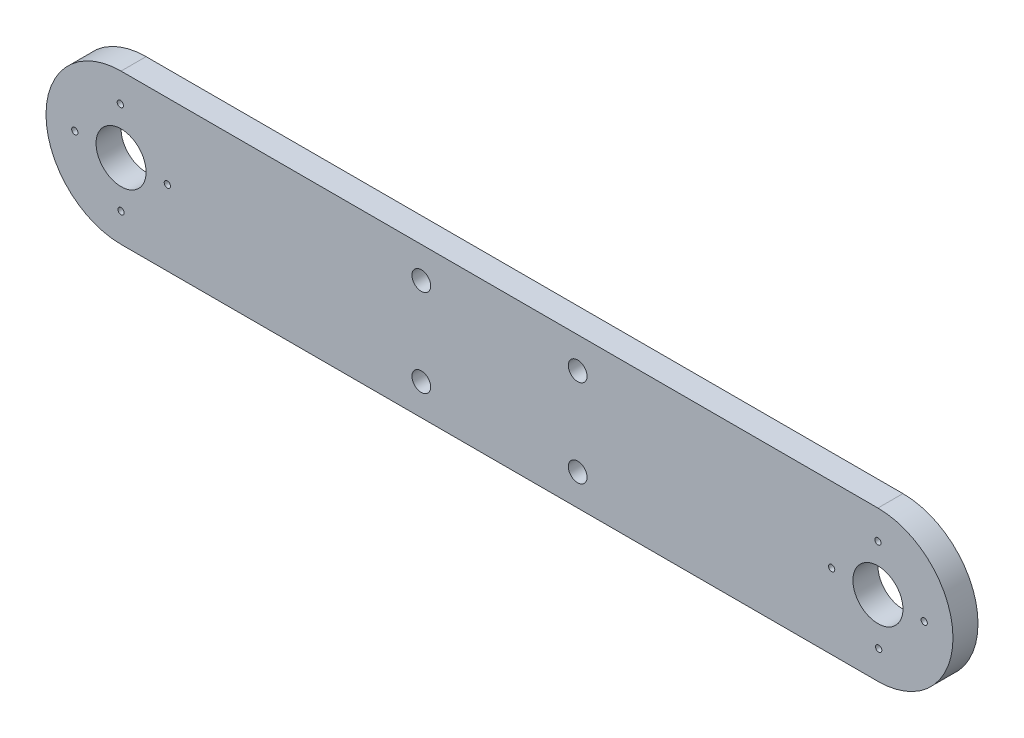
ISO-10303-21;
HEADER;
FILE_DESCRIPTION(('STEP AP214'),'2;1');
FILE_NAME('part.step','',(''),(''),'','','');
FILE_SCHEMA(('AUTOMOTIVE_DESIGN { 1 0 10303 214 1 1 1 1 }'));
ENDSEC;
DATA;
#1=APPLICATION_CONTEXT('core data for automotive mechanical design processes');
#2=APPLICATION_PROTOCOL_DEFINITION('international standard','automotive_design',2000,#1);
#3=PRODUCT_CONTEXT('',#1,'mechanical');
#4=PRODUCT('Part','Part','',(#3));
#5=PRODUCT_RELATED_PRODUCT_CATEGORY('part','',(#4));
#6=PRODUCT_DEFINITION_FORMATION('','',#4);
#7=PRODUCT_DEFINITION_CONTEXT('part definition',#1,'design');
#8=PRODUCT_DEFINITION('design','',#6,#7);
#9=PRODUCT_DEFINITION_SHAPE('','',#8);
#10=(LENGTH_UNIT() NAMED_UNIT(*) SI_UNIT(.MILLI.,.METRE.));
#11=(NAMED_UNIT(*) PLANE_ANGLE_UNIT() SI_UNIT($,.RADIAN.));
#12=(NAMED_UNIT(*) SI_UNIT($,.STERADIAN.) SOLID_ANGLE_UNIT());
#13=UNCERTAINTY_MEASURE_WITH_UNIT(LENGTH_MEASURE(1.E-05),#10,'distance_accuracy_value','');
#14=(GEOMETRIC_REPRESENTATION_CONTEXT(3) GLOBAL_UNCERTAINTY_ASSIGNED_CONTEXT((#13)) GLOBAL_UNIT_ASSIGNED_CONTEXT((#10,
#11,#12)) REPRESENTATION_CONTEXT('',''));
#15=CARTESIAN_POINT('',(0.,0.,0.));
#16=DIRECTION('',(0.,0.,1.));
#17=DIRECTION('',(1.,0.,0.));
#18=AXIS2_PLACEMENT_3D('',#15,#16,#17);
#19=CARTESIAN_POINT('',(12.,12.,4.));
#20=DIRECTION('',(0.,0.,1.));
#21=DIRECTION('',(1.,0.,0.));
#22=AXIS2_PLACEMENT_3D('',#19,#20,#21);
#23=PLANE('',#22);
#24=CARTESIAN_POINT('',(4.59999999999999,12.,4.));
#25=DIRECTION('',(0.,0.,1.));
#26=DIRECTION('',(1.,0.,0.));
#27=AXIS2_PLACEMENT_3D('',#24,#25,#26);
#28=CIRCLE('',#27,0.5);
#29=CARTESIAN_POINT('',(5.09999999999999,12.,4.));
#30=VERTEX_POINT('',#29);
#31=EDGE_CURVE('E180',#30,#30,#28,.T.);
#32=ORIENTED_EDGE('',*,*,#31,.F.);
#33=EDGE_LOOP('',(#32));
#34=FACE_BOUND('',#33,.T.);
#35=CARTESIAN_POINT('',(12.,4.6,4.));
#36=DIRECTION('',(0.,0.,1.));
#37=DIRECTION('',(1.,0.,0.));
#38=AXIS2_PLACEMENT_3D('',#35,#36,#37);
#39=CIRCLE('',#38,0.5);
#40=CARTESIAN_POINT('',(12.5,4.6,4.));
#41=VERTEX_POINT('',#40);
#42=EDGE_CURVE('E168',#41,#41,#39,.T.);
#43=ORIENTED_EDGE('',*,*,#42,.F.);
#44=EDGE_LOOP('',(#43));
#45=FACE_BOUND('',#44,.T.);
#46=CARTESIAN_POINT('',(85.,19.,4.));
#47=DIRECTION('',(0.,0.,1.));
#48=DIRECTION('',(1.,0.,0.));
#49=AXIS2_PLACEMENT_3D('',#46,#47,#48);
#50=CIRCLE('',#49,1.5);
#51=CARTESIAN_POINT('',(86.5,19.,4.));
#52=VERTEX_POINT('',#51);
#53=EDGE_CURVE('E156',#52,#52,#50,.T.);
#54=ORIENTED_EDGE('',*,*,#53,.F.);
#55=EDGE_LOOP('',(#54));
#56=FACE_BOUND('',#55,.T.);
#57=CARTESIAN_POINT('',(60.,19.,4.));
#58=DIRECTION('',(0.,0.,1.));
#59=DIRECTION('',(1.,0.,0.));
#60=AXIS2_PLACEMENT_3D('',#57,#58,#59);
#61=CIRCLE('',#60,1.5);
#62=CARTESIAN_POINT('',(61.5,19.,4.));
#63=VERTEX_POINT('',#62);
#64=EDGE_CURVE('E144',#63,#63,#61,.T.);
#65=ORIENTED_EDGE('',*,*,#64,.F.);
#66=EDGE_LOOP('',(#65));
#67=FACE_BOUND('',#66,.T.);
#68=CARTESIAN_POINT('',(125.6,12.,4.));
#69=DIRECTION('',(0.,0.,1.));
#70=DIRECTION('',(1.,0.,0.));
#71=AXIS2_PLACEMENT_3D('',#68,#69,#70);
#72=CIRCLE('',#71,0.5);
#73=CARTESIAN_POINT('',(126.1,12.,4.));
#74=VERTEX_POINT('',#73);
#75=EDGE_CURVE('E132',#74,#74,#72,.T.);
#76=ORIENTED_EDGE('',*,*,#75,.F.);
#77=EDGE_LOOP('',(#76));
#78=FACE_BOUND('',#77,.T.);
#79=CARTESIAN_POINT('',(133.121025162147,4.60098973442209,4.));
#80=DIRECTION('',(0.,0.,1.));
#81=DIRECTION('',(1.,0.,0.));
#82=AXIS2_PLACEMENT_3D('',#79,#80,#81);
#83=CIRCLE('',#82,0.5);
#84=CARTESIAN_POINT('',(133.621025162147,4.60098973442209,4.));
#85=VERTEX_POINT('',#84);
#86=EDGE_CURVE('E120',#85,#85,#83,.T.);
#87=ORIENTED_EDGE('',*,*,#86,.F.);
#88=EDGE_LOOP('',(#87));
#89=FACE_BOUND('',#88,.T.);
#90=CARTESIAN_POINT('',(133.,12.,4.));
#91=DIRECTION('',(0.,0.,1.));
#92=DIRECTION('',(1.,0.,0.));
#93=AXIS2_PLACEMENT_3D('',#90,#91,#92);
#94=CIRCLE('',#93,4.);
#95=CARTESIAN_POINT('',(137.,12.,4.));
#96=VERTEX_POINT('',#95);
#97=EDGE_CURVE('E99',#96,#96,#94,.T.);
#98=ORIENTED_EDGE('',*,*,#97,.F.);
#99=EDGE_LOOP('',(#98));
#100=FACE_BOUND('',#99,.T.);
#101=CARTESIAN_POINT('',(12.,12.,4.));
#102=DIRECTION('',(0.,0.,1.));
#103=DIRECTION('',(1.,0.,0.));
#104=AXIS2_PLACEMENT_3D('',#101,#102,#103);
#105=CIRCLE('',#104,12.);
#106=CARTESIAN_POINT('',(12.,24.,4.));
#107=VERTEX_POINT('',#106);
#108=CARTESIAN_POINT('',(12.,0.,4.));
#109=VERTEX_POINT('',#108);
#110=EDGE_CURVE('E84',#107,#109,#105,.T.);
#111=ORIENTED_EDGE('',*,*,#110,.T.);
#112=DIRECTION('',(1.,0.,0.));
#113=VECTOR('',#112,1.);
#114=CARTESIAN_POINT('',(133.,0.,4.));
#115=LINE('',#114,#113);
#116=CARTESIAN_POINT('',(133.,0.,4.));
#117=VERTEX_POINT('',#116);
#118=EDGE_CURVE('E79',#109,#117,#115,.T.);
#119=ORIENTED_EDGE('',*,*,#118,.T.);
#120=CARTESIAN_POINT('',(133.,12.,4.));
#121=DIRECTION('',(0.,0.,1.));
#122=DIRECTION('',(1.,0.,0.));
#123=AXIS2_PLACEMENT_3D('',#120,#121,#122);
#124=CIRCLE('',#123,12.);
#125=CARTESIAN_POINT('',(133.,24.,4.));
#126=VERTEX_POINT('',#125);
#127=EDGE_CURVE('E82',#117,#126,#124,.T.);
#128=ORIENTED_EDGE('',*,*,#127,.T.);
#129=DIRECTION('',(-1.,0.,0.));
#130=VECTOR('',#129,1.);
#131=CARTESIAN_POINT('',(12.,24.,4.));
#132=LINE('',#131,#130);
#133=EDGE_CURVE('E49',#126,#107,#132,.T.);
#134=ORIENTED_EDGE('',*,*,#133,.T.);
#135=EDGE_LOOP('',(#111,#119,#128,#134));
#136=FACE_BOUND('',#135,.T.);
#137=CARTESIAN_POINT('',(133.,19.4,4.));
#138=DIRECTION('',(0.,0.,1.));
#139=DIRECTION('',(1.,0.,0.));
#140=AXIS2_PLACEMENT_3D('',#137,#138,#139);
#141=CIRCLE('',#140,0.5);
#142=CARTESIAN_POINT('',(133.5,19.4,4.));
#143=VERTEX_POINT('',#142);
#144=EDGE_CURVE('E114',#143,#143,#141,.T.);
#145=ORIENTED_EDGE('',*,*,#144,.F.);
#146=EDGE_LOOP('',(#145));
#147=FACE_BOUND('',#146,.T.);
#148=CARTESIAN_POINT('',(140.4,12.,4.));
#149=DIRECTION('',(0.,0.,1.));
#150=DIRECTION('',(1.,0.,0.));
#151=AXIS2_PLACEMENT_3D('',#148,#149,#150);
#152=CIRCLE('',#151,0.5);
#153=CARTESIAN_POINT('',(140.9,12.,4.));
#154=VERTEX_POINT('',#153);
#155=EDGE_CURVE('E126',#154,#154,#152,.T.);
#156=ORIENTED_EDGE('',*,*,#155,.F.);
#157=EDGE_LOOP('',(#156));
#158=FACE_BOUND('',#157,.T.);
#159=CARTESIAN_POINT('',(60.,5.,4.));
#160=DIRECTION('',(0.,0.,1.));
#161=DIRECTION('',(1.,0.,0.));
#162=AXIS2_PLACEMENT_3D('',#159,#160,#161);
#163=CIRCLE('',#162,1.5);
#164=CARTESIAN_POINT('',(61.5,5.,4.));
#165=VERTEX_POINT('',#164);
#166=EDGE_CURVE('E138',#165,#165,#163,.T.);
#167=ORIENTED_EDGE('',*,*,#166,.F.);
#168=EDGE_LOOP('',(#167));
#169=FACE_BOUND('',#168,.T.);
#170=CARTESIAN_POINT('',(85.,5.,4.));
#171=DIRECTION('',(0.,0.,1.));
#172=DIRECTION('',(1.,0.,0.));
#173=AXIS2_PLACEMENT_3D('',#170,#171,#172);
#174=CIRCLE('',#173,1.5);
#175=CARTESIAN_POINT('',(86.5,5.,4.));
#176=VERTEX_POINT('',#175);
#177=EDGE_CURVE('E150',#176,#176,#174,.T.);
#178=ORIENTED_EDGE('',*,*,#177,.F.);
#179=EDGE_LOOP('',(#178));
#180=FACE_BOUND('',#179,.T.);
#181=CARTESIAN_POINT('',(12.,12.,4.));
#182=DIRECTION('',(0.,0.,1.));
#183=DIRECTION('',(1.,0.,0.));
#184=AXIS2_PLACEMENT_3D('',#181,#182,#183);
#185=CIRCLE('',#184,3.99999999999999);
#186=CARTESIAN_POINT('',(16.,12.,4.));
#187=VERTEX_POINT('',#186);
#188=EDGE_CURVE('E162',#187,#187,#185,.T.);
#189=ORIENTED_EDGE('',*,*,#188,.F.);
#190=EDGE_LOOP('',(#189));
#191=FACE_BOUND('',#190,.T.);
#192=CARTESIAN_POINT('',(11.8789748378531,19.3990102655779,4.));
#193=DIRECTION('',(0.,0.,1.));
#194=DIRECTION('',(1.,0.,0.));
#195=AXIS2_PLACEMENT_3D('',#192,#193,#194);
#196=CIRCLE('',#195,0.5);
#197=CARTESIAN_POINT('',(12.3789748378531,19.3990102655779,4.));
#198=VERTEX_POINT('',#197);
#199=EDGE_CURVE('E174',#198,#198,#196,.T.);
#200=ORIENTED_EDGE('',*,*,#199,.F.);
#201=EDGE_LOOP('',(#200));
#202=FACE_BOUND('',#201,.T.);
#203=CARTESIAN_POINT('',(19.4,12.,4.));
#204=DIRECTION('',(0.,0.,1.));
#205=DIRECTION('',(1.,0.,0.));
#206=AXIS2_PLACEMENT_3D('',#203,#204,#205);
#207=CIRCLE('',#206,0.5);
#208=CARTESIAN_POINT('',(19.9,12.,4.));
#209=VERTEX_POINT('',#208);
#210=EDGE_CURVE('E186',#209,#209,#207,.T.);
#211=ORIENTED_EDGE('',*,*,#210,.F.);
#212=EDGE_LOOP('',(#211));
#213=FACE_BOUND('',#212,.T.);
#214=ADVANCED_FACE('F32',(#34,#45,#56,#67,#78,#89,#100,#136,#147,#158,#169,#180,#191,#202,#213),
#23,.T.);
#215=CARTESIAN_POINT('',(12.,12.,0.));
#216=DIRECTION('',(0.,0.,1.));
#217=DIRECTION('',(1.,0.,0.));
#218=AXIS2_PLACEMENT_3D('',#215,#216,#217);
#219=PLANE('',#218);
#220=CARTESIAN_POINT('',(4.59999999999999,12.,0.));
#221=DIRECTION('',(0.,0.,1.));
#222=DIRECTION('',(1.,0.,0.));
#223=AXIS2_PLACEMENT_3D('',#220,#221,#222);
#224=CIRCLE('',#223,0.5);
#225=CARTESIAN_POINT('',(5.09999999999999,12.,0.));
#226=VERTEX_POINT('',#225);
#227=EDGE_CURVE('E183',#226,#226,#224,.T.);
#228=ORIENTED_EDGE('',*,*,#227,.T.);
#229=EDGE_LOOP('',(#228));
#230=FACE_BOUND('',#229,.T.);
#231=CARTESIAN_POINT('',(12.,4.6,0.));
#232=DIRECTION('',(0.,0.,1.));
#233=DIRECTION('',(1.,0.,0.));
#234=AXIS2_PLACEMENT_3D('',#231,#232,#233);
#235=CIRCLE('',#234,0.5);
#236=CARTESIAN_POINT('',(12.5,4.6,0.));
#237=VERTEX_POINT('',#236);
#238=EDGE_CURVE('E171',#237,#237,#235,.T.);
#239=ORIENTED_EDGE('',*,*,#238,.T.);
#240=EDGE_LOOP('',(#239));
#241=FACE_BOUND('',#240,.T.);
#242=CARTESIAN_POINT('',(85.,19.,0.));
#243=DIRECTION('',(0.,0.,1.));
#244=DIRECTION('',(1.,0.,0.));
#245=AXIS2_PLACEMENT_3D('',#242,#243,#244);
#246=CIRCLE('',#245,1.5);
#247=CARTESIAN_POINT('',(86.5,19.,0.));
#248=VERTEX_POINT('',#247);
#249=EDGE_CURVE('E159',#248,#248,#246,.T.);
#250=ORIENTED_EDGE('',*,*,#249,.T.);
#251=EDGE_LOOP('',(#250));
#252=FACE_BOUND('',#251,.T.);
#253=CARTESIAN_POINT('',(60.,19.,0.));
#254=DIRECTION('',(0.,0.,1.));
#255=DIRECTION('',(1.,0.,0.));
#256=AXIS2_PLACEMENT_3D('',#253,#254,#255);
#257=CIRCLE('',#256,1.5);
#258=CARTESIAN_POINT('',(61.5,19.,0.));
#259=VERTEX_POINT('',#258);
#260=EDGE_CURVE('E147',#259,#259,#257,.T.);
#261=ORIENTED_EDGE('',*,*,#260,.T.);
#262=EDGE_LOOP('',(#261));
#263=FACE_BOUND('',#262,.T.);
#264=CARTESIAN_POINT('',(125.6,12.,0.));
#265=DIRECTION('',(0.,0.,1.));
#266=DIRECTION('',(1.,0.,0.));
#267=AXIS2_PLACEMENT_3D('',#264,#265,#266);
#268=CIRCLE('',#267,0.5);
#269=CARTESIAN_POINT('',(126.1,12.,0.));
#270=VERTEX_POINT('',#269);
#271=EDGE_CURVE('E135',#270,#270,#268,.T.);
#272=ORIENTED_EDGE('',*,*,#271,.T.);
#273=EDGE_LOOP('',(#272));
#274=FACE_BOUND('',#273,.T.);
#275=CARTESIAN_POINT('',(133.121025162147,4.60098973442209,0.));
#276=DIRECTION('',(0.,0.,1.));
#277=DIRECTION('',(1.,0.,0.));
#278=AXIS2_PLACEMENT_3D('',#275,#276,#277);
#279=CIRCLE('',#278,0.5);
#280=CARTESIAN_POINT('',(133.621025162147,4.60098973442209,0.));
#281=VERTEX_POINT('',#280);
#282=EDGE_CURVE('E123',#281,#281,#279,.T.);
#283=ORIENTED_EDGE('',*,*,#282,.T.);
#284=EDGE_LOOP('',(#283));
#285=FACE_BOUND('',#284,.T.);
#286=CARTESIAN_POINT('',(133.,12.,0.));
#287=DIRECTION('',(0.,0.,1.));
#288=DIRECTION('',(1.,0.,0.));
#289=AXIS2_PLACEMENT_3D('',#286,#287,#288);
#290=CIRCLE('',#289,4.);
#291=CARTESIAN_POINT('',(137.,12.,0.));
#292=VERTEX_POINT('',#291);
#293=EDGE_CURVE('E111',#292,#292,#290,.T.);
#294=ORIENTED_EDGE('',*,*,#293,.T.);
#295=EDGE_LOOP('',(#294));
#296=FACE_BOUND('',#295,.T.);
#297=CARTESIAN_POINT('',(12.,12.,0.));
#298=DIRECTION('',(0.,0.,1.));
#299=DIRECTION('',(1.,0.,0.));
#300=AXIS2_PLACEMENT_3D('',#297,#298,#299);
#301=CIRCLE('',#300,12.);
#302=CARTESIAN_POINT('',(12.,24.,0.));
#303=VERTEX_POINT('',#302);
#304=CARTESIAN_POINT('',(12.,0.,0.));
#305=VERTEX_POINT('',#304);
#306=EDGE_CURVE('E96',#303,#305,#301,.T.);
#307=ORIENTED_EDGE('',*,*,#306,.F.);
#308=DIRECTION('',(-1.,0.,0.));
#309=VECTOR('',#308,1.);
#310=CARTESIAN_POINT('',(12.,24.,0.));
#311=LINE('',#310,#309);
#312=CARTESIAN_POINT('',(133.,24.,0.));
#313=VERTEX_POINT('',#312);
#314=EDGE_CURVE('E72',#313,#303,#311,.T.);
#315=ORIENTED_EDGE('',*,*,#314,.F.);
#316=CARTESIAN_POINT('',(133.,12.,0.));
#317=DIRECTION('',(0.,0.,1.));
#318=DIRECTION('',(1.,0.,0.));
#319=AXIS2_PLACEMENT_3D('',#316,#317,#318);
#320=CIRCLE('',#319,12.);
#321=CARTESIAN_POINT('',(133.,0.,0.));
#322=VERTEX_POINT('',#321);
#323=EDGE_CURVE('E66',#322,#313,#320,.T.);
#324=ORIENTED_EDGE('',*,*,#323,.F.);
#325=DIRECTION('',(1.,0.,0.));
#326=VECTOR('',#325,1.);
#327=CARTESIAN_POINT('',(133.,0.,0.));
#328=LINE('',#327,#326);
#329=EDGE_CURVE('E88',#305,#322,#328,.T.);
#330=ORIENTED_EDGE('',*,*,#329,.F.);
#331=EDGE_LOOP('',(#307,#315,#324,#330));
#332=FACE_BOUND('',#331,.T.);
#333=CARTESIAN_POINT('',(133.,19.4,0.));
#334=DIRECTION('',(0.,0.,1.));
#335=DIRECTION('',(1.,0.,0.));
#336=AXIS2_PLACEMENT_3D('',#333,#334,#335);
#337=CIRCLE('',#336,0.5);
#338=CARTESIAN_POINT('',(133.5,19.4,0.));
#339=VERTEX_POINT('',#338);
#340=EDGE_CURVE('E117',#339,#339,#337,.T.);
#341=ORIENTED_EDGE('',*,*,#340,.T.);
#342=EDGE_LOOP('',(#341));
#343=FACE_BOUND('',#342,.T.);
#344=CARTESIAN_POINT('',(140.4,12.,0.));
#345=DIRECTION('',(0.,0.,1.));
#346=DIRECTION('',(1.,0.,0.));
#347=AXIS2_PLACEMENT_3D('',#344,#345,#346);
#348=CIRCLE('',#347,0.5);
#349=CARTESIAN_POINT('',(140.9,12.,0.));
#350=VERTEX_POINT('',#349);
#351=EDGE_CURVE('E129',#350,#350,#348,.T.);
#352=ORIENTED_EDGE('',*,*,#351,.T.);
#353=EDGE_LOOP('',(#352));
#354=FACE_BOUND('',#353,.T.);
#355=CARTESIAN_POINT('',(60.,5.,0.));
#356=DIRECTION('',(0.,0.,1.));
#357=DIRECTION('',(1.,0.,0.));
#358=AXIS2_PLACEMENT_3D('',#355,#356,#357);
#359=CIRCLE('',#358,1.5);
#360=CARTESIAN_POINT('',(61.5,5.,0.));
#361=VERTEX_POINT('',#360);
#362=EDGE_CURVE('E141',#361,#361,#359,.T.);
#363=ORIENTED_EDGE('',*,*,#362,.T.);
#364=EDGE_LOOP('',(#363));
#365=FACE_BOUND('',#364,.T.);
#366=CARTESIAN_POINT('',(85.,5.,0.));
#367=DIRECTION('',(0.,0.,1.));
#368=DIRECTION('',(1.,0.,0.));
#369=AXIS2_PLACEMENT_3D('',#366,#367,#368);
#370=CIRCLE('',#369,1.5);
#371=CARTESIAN_POINT('',(86.5,5.,0.));
#372=VERTEX_POINT('',#371);
#373=EDGE_CURVE('E153',#372,#372,#370,.T.);
#374=ORIENTED_EDGE('',*,*,#373,.T.);
#375=EDGE_LOOP('',(#374));
#376=FACE_BOUND('',#375,.T.);
#377=CARTESIAN_POINT('',(12.,12.,0.));
#378=DIRECTION('',(0.,0.,1.));
#379=DIRECTION('',(1.,0.,0.));
#380=AXIS2_PLACEMENT_3D('',#377,#378,#379);
#381=CIRCLE('',#380,3.99999999999999);
#382=CARTESIAN_POINT('',(16.,12.,0.));
#383=VERTEX_POINT('',#382);
#384=EDGE_CURVE('E165',#383,#383,#381,.T.);
#385=ORIENTED_EDGE('',*,*,#384,.T.);
#386=EDGE_LOOP('',(#385));
#387=FACE_BOUND('',#386,.T.);
#388=CARTESIAN_POINT('',(11.8789748378531,19.3990102655779,0.));
#389=DIRECTION('',(0.,0.,1.));
#390=DIRECTION('',(1.,0.,0.));
#391=AXIS2_PLACEMENT_3D('',#388,#389,#390);
#392=CIRCLE('',#391,0.5);
#393=CARTESIAN_POINT('',(12.3789748378531,19.3990102655779,0.));
#394=VERTEX_POINT('',#393);
#395=EDGE_CURVE('E177',#394,#394,#392,.T.);
#396=ORIENTED_EDGE('',*,*,#395,.T.);
#397=EDGE_LOOP('',(#396));
#398=FACE_BOUND('',#397,.T.);
#399=CARTESIAN_POINT('',(19.4,12.,0.));
#400=DIRECTION('',(0.,0.,1.));
#401=DIRECTION('',(1.,0.,0.));
#402=AXIS2_PLACEMENT_3D('',#399,#400,#401);
#403=CIRCLE('',#402,0.5);
#404=CARTESIAN_POINT('',(19.9,12.,0.));
#405=VERTEX_POINT('',#404);
#406=EDGE_CURVE('E189',#405,#405,#403,.T.);
#407=ORIENTED_EDGE('',*,*,#406,.T.);
#408=EDGE_LOOP('',(#407));
#409=FACE_BOUND('',#408,.T.);
#410=ADVANCED_FACE('F107',(#230,#241,#252,#263,#274,#285,#296,#332,#343,#354,#365,#376,#387,
#398,#409),#219,.F.);
#411=CARTESIAN_POINT('',(12.,12.,4.));
#412=DIRECTION('',(0.,0.,-1.));
#413=DIRECTION('',(-1.,0.,0.));
#414=AXIS2_PLACEMENT_3D('',#411,#412,#413);
#415=CYLINDRICAL_SURFACE('',#414,12.);
#416=ORIENTED_EDGE('',*,*,#306,.T.);
#417=DIRECTION('',(0.,0.,-1.));
#418=VECTOR('',#417,1.);
#419=CARTESIAN_POINT('',(12.,0.,4.));
#420=LINE('',#419,#418);
#421=EDGE_CURVE('E11',#109,#305,#420,.T.);
#422=ORIENTED_EDGE('',*,*,#421,.F.);
#423=ORIENTED_EDGE('',*,*,#110,.F.);
#424=DIRECTION('',(0.,0.,-1.));
#425=VECTOR('',#424,1.);
#426=CARTESIAN_POINT('',(12.,24.,4.));
#427=LINE('',#426,#425);
#428=EDGE_CURVE('E92',#107,#303,#427,.T.);
#429=ORIENTED_EDGE('',*,*,#428,.T.);
#430=EDGE_LOOP('',(#416,#422,#423,#429));
#431=FACE_BOUND('',#430,.T.);
#432=ADVANCED_FACE('F34',(#431),#415,.T.);
#433=CARTESIAN_POINT('',(133.,0.,4.));
#434=DIRECTION('',(0.,1.,0.));
#435=DIRECTION('',(0.,0.,1.));
#436=AXIS2_PLACEMENT_3D('',#433,#434,#435);
#437=PLANE('',#436);
#438=ORIENTED_EDGE('',*,*,#329,.T.);
#439=DIRECTION('',(0.,0.,-1.));
#440=VECTOR('',#439,1.);
#441=CARTESIAN_POINT('',(133.,0.,4.));
#442=LINE('',#441,#440);
#443=EDGE_CURVE('E41',#117,#322,#442,.T.);
#444=ORIENTED_EDGE('',*,*,#443,.F.);
#445=ORIENTED_EDGE('',*,*,#118,.F.);
#446=ORIENTED_EDGE('',*,*,#421,.T.);
#447=EDGE_LOOP('',(#438,#444,#445,#446));
#448=FACE_BOUND('',#447,.T.);
#449=ADVANCED_FACE('F87',(#448),#437,.F.);
#450=CARTESIAN_POINT('',(133.,12.,4.));
#451=DIRECTION('',(0.,0.,-1.));
#452=DIRECTION('',(-1.,0.,0.));
#453=AXIS2_PLACEMENT_3D('',#450,#451,#452);
#454=CYLINDRICAL_SURFACE('',#453,12.);
#455=ORIENTED_EDGE('',*,*,#323,.T.);
#456=DIRECTION('',(0.,0.,-1.));
#457=VECTOR('',#456,1.);
#458=CARTESIAN_POINT('',(133.,24.,4.));
#459=LINE('',#458,#457);
#460=EDGE_CURVE('E89',#126,#313,#459,.T.);
#461=ORIENTED_EDGE('',*,*,#460,.F.);
#462=ORIENTED_EDGE('',*,*,#127,.F.);
#463=ORIENTED_EDGE('',*,*,#443,.T.);
#464=EDGE_LOOP('',(#455,#461,#462,#463));
#465=FACE_BOUND('',#464,.T.);
#466=ADVANCED_FACE('F90',(#465),#454,.T.);
#467=CARTESIAN_POINT('',(12.,24.,4.));
#468=DIRECTION('',(0.,-1.,0.));
#469=DIRECTION('',(0.,0.,-1.));
#470=AXIS2_PLACEMENT_3D('',#467,#468,#469);
#471=PLANE('',#470);
#472=ORIENTED_EDGE('',*,*,#314,.T.);
#473=ORIENTED_EDGE('',*,*,#428,.F.);
#474=ORIENTED_EDGE('',*,*,#133,.F.);
#475=ORIENTED_EDGE('',*,*,#460,.T.);
#476=EDGE_LOOP('',(#472,#473,#474,#475));
#477=FACE_BOUND('',#476,.T.);
#478=ADVANCED_FACE('F104',(#477),#471,.F.);
#479=CARTESIAN_POINT('',(133.,12.,4.));
#480=DIRECTION('',(0.,0.,-1.));
#481=DIRECTION('',(-1.,0.,0.));
#482=AXIS2_PLACEMENT_3D('',#479,#480,#481);
#483=CYLINDRICAL_SURFACE('',#482,4.);
#484=ORIENTED_EDGE('',*,*,#97,.T.);
#485=EDGE_LOOP('',(#484));
#486=FACE_BOUND('',#485,.T.);
#487=ORIENTED_EDGE('',*,*,#293,.F.);
#488=EDGE_LOOP('',(#487));
#489=FACE_BOUND('',#488,.T.);
#490=ADVANCED_FACE('F209',(#486,#489),#483,.F.);
#491=CARTESIAN_POINT('',(133.,19.4,4.));
#492=DIRECTION('',(0.,0.,-1.));
#493=DIRECTION('',(-1.,0.,0.));
#494=AXIS2_PLACEMENT_3D('',#491,#492,#493);
#495=CYLINDRICAL_SURFACE('',#494,0.5);
#496=ORIENTED_EDGE('',*,*,#144,.T.);
#497=EDGE_LOOP('',(#496));
#498=FACE_BOUND('',#497,.T.);
#499=ORIENTED_EDGE('',*,*,#340,.F.);
#500=EDGE_LOOP('',(#499));
#501=FACE_BOUND('',#500,.T.);
#502=ADVANCED_FACE('F255',(#498,#501),#495,.F.);
#503=CARTESIAN_POINT('',(133.121025162147,4.60098973442209,4.));
#504=DIRECTION('',(0.,0.,-1.));
#505=DIRECTION('',(-1.,0.,0.));
#506=AXIS2_PLACEMENT_3D('',#503,#504,#505);
#507=CYLINDRICAL_SURFACE('',#506,0.5);
#508=ORIENTED_EDGE('',*,*,#86,.T.);
#509=EDGE_LOOP('',(#508));
#510=FACE_BOUND('',#509,.T.);
#511=ORIENTED_EDGE('',*,*,#282,.F.);
#512=EDGE_LOOP('',(#511));
#513=FACE_BOUND('',#512,.T.);
#514=ADVANCED_FACE('F263',(#510,#513),#507,.F.);
#515=CARTESIAN_POINT('',(140.4,12.,4.));
#516=DIRECTION('',(0.,0.,-1.));
#517=DIRECTION('',(-1.,0.,0.));
#518=AXIS2_PLACEMENT_3D('',#515,#516,#517);
#519=CYLINDRICAL_SURFACE('',#518,0.5);
#520=ORIENTED_EDGE('',*,*,#155,.T.);
#521=EDGE_LOOP('',(#520));
#522=FACE_BOUND('',#521,.T.);
#523=ORIENTED_EDGE('',*,*,#351,.F.);
#524=EDGE_LOOP('',(#523));
#525=FACE_BOUND('',#524,.T.);
#526=ADVANCED_FACE('F271',(#522,#525),#519,.F.);
#527=CARTESIAN_POINT('',(125.6,12.,4.));
#528=DIRECTION('',(0.,0.,-1.));
#529=DIRECTION('',(-1.,0.,0.));
#530=AXIS2_PLACEMENT_3D('',#527,#528,#529);
#531=CYLINDRICAL_SURFACE('',#530,0.5);
#532=ORIENTED_EDGE('',*,*,#75,.T.);
#533=EDGE_LOOP('',(#532));
#534=FACE_BOUND('',#533,.T.);
#535=ORIENTED_EDGE('',*,*,#271,.F.);
#536=EDGE_LOOP('',(#535));
#537=FACE_BOUND('',#536,.T.);
#538=ADVANCED_FACE('F280',(#534,#537),#531,.F.);
#539=CARTESIAN_POINT('',(60.,5.,4.));
#540=DIRECTION('',(0.,0.,-1.));
#541=DIRECTION('',(-1.,0.,0.));
#542=AXIS2_PLACEMENT_3D('',#539,#540,#541);
#543=CYLINDRICAL_SURFACE('',#542,1.5);
#544=ORIENTED_EDGE('',*,*,#166,.T.);
#545=EDGE_LOOP('',(#544));
#546=FACE_BOUND('',#545,.T.);
#547=ORIENTED_EDGE('',*,*,#362,.F.);
#548=EDGE_LOOP('',(#547));
#549=FACE_BOUND('',#548,.T.);
#550=ADVANCED_FACE('F289',(#546,#549),#543,.F.);
#551=CARTESIAN_POINT('',(60.,19.,4.));
#552=DIRECTION('',(0.,0.,-1.));
#553=DIRECTION('',(-1.,0.,0.));
#554=AXIS2_PLACEMENT_3D('',#551,#552,#553);
#555=CYLINDRICAL_SURFACE('',#554,1.5);
#556=ORIENTED_EDGE('',*,*,#64,.T.);
#557=EDGE_LOOP('',(#556));
#558=FACE_BOUND('',#557,.T.);
#559=ORIENTED_EDGE('',*,*,#260,.F.);
#560=EDGE_LOOP('',(#559));
#561=FACE_BOUND('',#560,.T.);
#562=ADVANCED_FACE('F298',(#558,#561),#555,.F.);
#563=CARTESIAN_POINT('',(85.,5.,4.));
#564=DIRECTION('',(0.,0.,-1.));
#565=DIRECTION('',(-1.,0.,0.));
#566=AXIS2_PLACEMENT_3D('',#563,#564,#565);
#567=CYLINDRICAL_SURFACE('',#566,1.5);
#568=ORIENTED_EDGE('',*,*,#177,.T.);
#569=EDGE_LOOP('',(#568));
#570=FACE_BOUND('',#569,.T.);
#571=ORIENTED_EDGE('',*,*,#373,.F.);
#572=EDGE_LOOP('',(#571));
#573=FACE_BOUND('',#572,.T.);
#574=ADVANCED_FACE('F307',(#570,#573),#567,.F.);
#575=CARTESIAN_POINT('',(85.,19.,4.));
#576=DIRECTION('',(0.,0.,-1.));
#577=DIRECTION('',(-1.,0.,0.));
#578=AXIS2_PLACEMENT_3D('',#575,#576,#577);
#579=CYLINDRICAL_SURFACE('',#578,1.5);
#580=ORIENTED_EDGE('',*,*,#53,.T.);
#581=EDGE_LOOP('',(#580));
#582=FACE_BOUND('',#581,.T.);
#583=ORIENTED_EDGE('',*,*,#249,.F.);
#584=EDGE_LOOP('',(#583));
#585=FACE_BOUND('',#584,.T.);
#586=ADVANCED_FACE('F316',(#582,#585),#579,.F.);
#587=CARTESIAN_POINT('',(12.,12.,4.));
#588=DIRECTION('',(0.,0.,-1.));
#589=DIRECTION('',(-1.,0.,0.));
#590=AXIS2_PLACEMENT_3D('',#587,#588,#589);
#591=CYLINDRICAL_SURFACE('',#590,3.99999999999999);
#592=ORIENTED_EDGE('',*,*,#188,.T.);
#593=EDGE_LOOP('',(#592));
#594=FACE_BOUND('',#593,.T.);
#595=ORIENTED_EDGE('',*,*,#384,.F.);
#596=EDGE_LOOP('',(#595));
#597=FACE_BOUND('',#596,.T.);
#598=ADVANCED_FACE('F325',(#594,#597),#591,.F.);
#599=CARTESIAN_POINT('',(12.,4.6,4.));
#600=DIRECTION('',(0.,0.,-1.));
#601=DIRECTION('',(-1.,0.,0.));
#602=AXIS2_PLACEMENT_3D('',#599,#600,#601);
#603=CYLINDRICAL_SURFACE('',#602,0.5);
#604=ORIENTED_EDGE('',*,*,#42,.T.);
#605=EDGE_LOOP('',(#604));
#606=FACE_BOUND('',#605,.T.);
#607=ORIENTED_EDGE('',*,*,#238,.F.);
#608=EDGE_LOOP('',(#607));
#609=FACE_BOUND('',#608,.T.);
#610=ADVANCED_FACE('F334',(#606,#609),#603,.F.);
#611=CARTESIAN_POINT('',(11.8789748378531,19.3990102655779,4.));
#612=DIRECTION('',(0.,0.,-1.));
#613=DIRECTION('',(-1.,0.,0.));
#614=AXIS2_PLACEMENT_3D('',#611,#612,#613);
#615=CYLINDRICAL_SURFACE('',#614,0.5);
#616=ORIENTED_EDGE('',*,*,#199,.T.);
#617=EDGE_LOOP('',(#616));
#618=FACE_BOUND('',#617,.T.);
#619=ORIENTED_EDGE('',*,*,#395,.F.);
#620=EDGE_LOOP('',(#619));
#621=FACE_BOUND('',#620,.T.);
#622=ADVANCED_FACE('F343',(#618,#621),#615,.F.);
#623=CARTESIAN_POINT('',(4.59999999999999,12.,4.));
#624=DIRECTION('',(0.,0.,-1.));
#625=DIRECTION('',(-1.,0.,0.));
#626=AXIS2_PLACEMENT_3D('',#623,#624,#625);
#627=CYLINDRICAL_SURFACE('',#626,0.5);
#628=ORIENTED_EDGE('',*,*,#31,.T.);
#629=EDGE_LOOP('',(#628));
#630=FACE_BOUND('',#629,.T.);
#631=ORIENTED_EDGE('',*,*,#227,.F.);
#632=EDGE_LOOP('',(#631));
#633=FACE_BOUND('',#632,.T.);
#634=ADVANCED_FACE('F352',(#630,#633),#627,.F.);
#635=CARTESIAN_POINT('',(19.4,12.,4.));
#636=DIRECTION('',(0.,0.,-1.));
#637=DIRECTION('',(-1.,0.,0.));
#638=AXIS2_PLACEMENT_3D('',#635,#636,#637);
#639=CYLINDRICAL_SURFACE('',#638,0.5);
#640=ORIENTED_EDGE('',*,*,#210,.T.);
#641=EDGE_LOOP('',(#640));
#642=FACE_BOUND('',#641,.T.);
#643=ORIENTED_EDGE('',*,*,#406,.F.);
#644=EDGE_LOOP('',(#643));
#645=FACE_BOUND('',#644,.T.);
#646=ADVANCED_FACE('F195',(#642,#645),#639,.F.);
#647=CLOSED_SHELL('',(#214,#410,#432,#449,#466,#478,#490,#502,#514,#526,#538,#550,#562,#574,
#586,#598,#610,#622,#634,#646));
#648=MANIFOLD_SOLID_BREP('B2',#647);
#649=ADVANCED_BREP_SHAPE_REPRESENTATION('',(#18,#648),#14);
#650=SHAPE_DEFINITION_REPRESENTATION(#9,#649);
ENDSEC;
END-ISO-10303-21;
